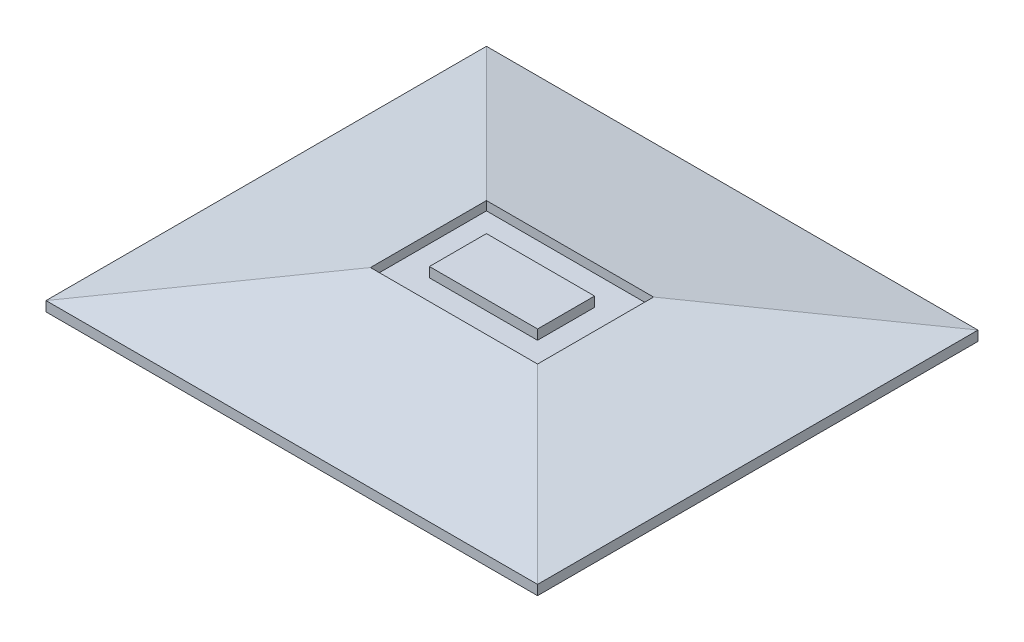
ISO-10303-21;
HEADER;
FILE_DESCRIPTION(('STEP AP214'),'2;1');
FILE_NAME('part.step','',(''),(''),'','','');
FILE_SCHEMA(('AUTOMOTIVE_DESIGN { 1 0 10303 214 1 1 1 1 }'));
ENDSEC;
DATA;
#1=APPLICATION_CONTEXT('core data for automotive mechanical design processes');
#2=APPLICATION_PROTOCOL_DEFINITION('international standard','automotive_design',2000,#1);
#3=PRODUCT_CONTEXT('',#1,'mechanical');
#4=PRODUCT('Part','Part','',(#3));
#5=PRODUCT_RELATED_PRODUCT_CATEGORY('part','',(#4));
#6=PRODUCT_DEFINITION_FORMATION('','',#4);
#7=PRODUCT_DEFINITION_CONTEXT('part definition',#1,'design');
#8=PRODUCT_DEFINITION('design','',#6,#7);
#9=PRODUCT_DEFINITION_SHAPE('','',#8);
#10=(LENGTH_UNIT() NAMED_UNIT(*) SI_UNIT(.MILLI.,.METRE.));
#11=(NAMED_UNIT(*) PLANE_ANGLE_UNIT() SI_UNIT($,.RADIAN.));
#12=(NAMED_UNIT(*) SI_UNIT($,.STERADIAN.) SOLID_ANGLE_UNIT());
#13=UNCERTAINTY_MEASURE_WITH_UNIT(LENGTH_MEASURE(1.E-05),#10,'distance_accuracy_value','');
#14=(GEOMETRIC_REPRESENTATION_CONTEXT(3) GLOBAL_UNCERTAINTY_ASSIGNED_CONTEXT((#13)) GLOBAL_UNIT_ASSIGNED_CONTEXT((#10,
#11,#12)) REPRESENTATION_CONTEXT('',''));
#15=CARTESIAN_POINT('',(0.,0.,0.));
#16=DIRECTION('',(0.,0.,1.));
#17=DIRECTION('',(1.,0.,0.));
#18=AXIS2_PLACEMENT_3D('',#15,#16,#17);
#19=CARTESIAN_POINT('',(0.,4.,0.));
#20=DIRECTION('',(1.,0.,0.));
#21=DIRECTION('',(0.,0.,-1.));
#22=AXIS2_PLACEMENT_3D('',#19,#20,#21);
#23=PLANE('',#22);
#24=DIRECTION('',(0.,-1.,0.));
#25=VECTOR('',#24,1.);
#26=CARTESIAN_POINT('',(0.,4.,44.8));
#27=LINE('',#26,#25);
#28=CARTESIAN_POINT('',(0.,0.999999999999997,44.8));
#29=VERTEX_POINT('',#28);
#30=CARTESIAN_POINT('',(0.,0.,44.8));
#31=VERTEX_POINT('',#30);
#32=EDGE_CURVE('E267',#29,#31,#27,.T.);
#33=ORIENTED_EDGE('',*,*,#32,.F.);
#34=DIRECTION('',(0.,0.,-1.));
#35=VECTOR('',#34,1.);
#36=CARTESIAN_POINT('',(0.,0.999999999999997,0.));
#37=LINE('',#36,#35);
#38=CARTESIAN_POINT('',(0.,0.999999999999997,0.));
#39=VERTEX_POINT('',#38);
#40=EDGE_CURVE('E277',#29,#39,#37,.T.);
#41=ORIENTED_EDGE('',*,*,#40,.T.);
#42=DIRECTION('',(0.,-1.,0.));
#43=VECTOR('',#42,1.);
#44=CARTESIAN_POINT('',(0.,4.,0.));
#45=LINE('',#44,#43);
#46=CARTESIAN_POINT('',(0.,0.,0.));
#47=VERTEX_POINT('',#46);
#48=EDGE_CURVE('E261',#39,#47,#45,.T.);
#49=ORIENTED_EDGE('',*,*,#48,.T.);
#50=DIRECTION('',(0.,0.,1.));
#51=VECTOR('',#50,1.);
#52=CARTESIAN_POINT('',(0.,0.,0.));
#53=LINE('',#52,#51);
#54=EDGE_CURVE('E248',#47,#31,#53,.T.);
#55=ORIENTED_EDGE('',*,*,#54,.T.);
#56=EDGE_LOOP('',(#33,#41,#49,#55));
#57=FACE_BOUND('',#56,.T.);
#58=ADVANCED_FACE('F36',(#57),#23,.F.);
#59=CARTESIAN_POINT('',(0.,4.,44.8));
#60=DIRECTION('',(0.,0.,-1.));
#61=DIRECTION('',(-1.,0.,0.));
#62=AXIS2_PLACEMENT_3D('',#59,#60,#61);
#63=PLANE('',#62);
#64=DIRECTION('',(0.,-1.,0.));
#65=VECTOR('',#64,1.);
#66=CARTESIAN_POINT('',(50.,4.,44.8));
#67=LINE('',#66,#65);
#68=CARTESIAN_POINT('',(50.,0.999999999999997,44.8));
#69=VERTEX_POINT('',#68);
#70=CARTESIAN_POINT('',(50.,0.,44.8));
#71=VERTEX_POINT('',#70);
#72=EDGE_CURVE('E265',#69,#71,#67,.T.);
#73=ORIENTED_EDGE('',*,*,#72,.F.);
#74=DIRECTION('',(-1.,0.,0.));
#75=VECTOR('',#74,1.);
#76=CARTESIAN_POINT('',(0.,0.999999999999997,44.8));
#77=LINE('',#76,#75);
#78=EDGE_CURVE('E272',#69,#29,#77,.T.);
#79=ORIENTED_EDGE('',*,*,#78,.T.);
#80=ORIENTED_EDGE('',*,*,#32,.T.);
#81=DIRECTION('',(1.,0.,0.));
#82=VECTOR('',#81,1.);
#83=CARTESIAN_POINT('',(0.,0.,44.8));
#84=LINE('',#83,#82);
#85=EDGE_CURVE('E251',#31,#71,#84,.T.);
#86=ORIENTED_EDGE('',*,*,#85,.T.);
#87=EDGE_LOOP('',(#73,#79,#80,#86));
#88=FACE_BOUND('',#87,.T.);
#89=ADVANCED_FACE('F309',(#88),#63,.F.);
#90=CARTESIAN_POINT('',(50.,4.,0.));
#91=DIRECTION('',(-1.,0.,0.));
#92=DIRECTION('',(0.,0.,1.));
#93=AXIS2_PLACEMENT_3D('',#90,#91,#92);
#94=PLANE('',#93);
#95=DIRECTION('',(0.,-1.,0.));
#96=VECTOR('',#95,1.);
#97=CARTESIAN_POINT('',(50.,4.,0.));
#98=LINE('',#97,#96);
#99=CARTESIAN_POINT('',(50.,0.999999999999997,0.));
#100=VERTEX_POINT('',#99);
#101=CARTESIAN_POINT('',(50.,0.,0.));
#102=VERTEX_POINT('',#101);
#103=EDGE_CURVE('E263',#100,#102,#98,.T.);
#104=ORIENTED_EDGE('',*,*,#103,.F.);
#105=DIRECTION('',(0.,0.,1.));
#106=VECTOR('',#105,1.);
#107=CARTESIAN_POINT('',(50.,0.999999999999997,44.8));
#108=LINE('',#107,#106);
#109=EDGE_CURVE('E269',#100,#69,#108,.T.);
#110=ORIENTED_EDGE('',*,*,#109,.T.);
#111=ORIENTED_EDGE('',*,*,#72,.T.);
#112=DIRECTION('',(0.,0.,-1.));
#113=VECTOR('',#112,1.);
#114=CARTESIAN_POINT('',(50.,0.,0.));
#115=LINE('',#114,#113);
#116=EDGE_CURVE('E255',#71,#102,#115,.T.);
#117=ORIENTED_EDGE('',*,*,#116,.T.);
#118=EDGE_LOOP('',(#104,#110,#111,#117));
#119=FACE_BOUND('',#118,.T.);
#120=ADVANCED_FACE('F307',(#119),#94,.F.);
#121=CARTESIAN_POINT('',(0.,4.,0.));
#122=DIRECTION('',(0.,0.,1.));
#123=DIRECTION('',(1.,0.,0.));
#124=AXIS2_PLACEMENT_3D('',#121,#122,#123);
#125=PLANE('',#124);
#126=ORIENTED_EDGE('',*,*,#48,.F.);
#127=DIRECTION('',(1.,0.,0.));
#128=VECTOR('',#127,1.);
#129=CARTESIAN_POINT('',(50.,0.999999999999997,0.));
#130=LINE('',#129,#128);
#131=EDGE_CURVE('E275',#39,#100,#130,.T.);
#132=ORIENTED_EDGE('',*,*,#131,.T.);
#133=ORIENTED_EDGE('',*,*,#103,.T.);
#134=DIRECTION('',(-1.,0.,0.));
#135=VECTOR('',#134,1.);
#136=CARTESIAN_POINT('',(0.,0.,0.));
#137=LINE('',#136,#135);
#138=EDGE_CURVE('E258',#102,#47,#137,.T.);
#139=ORIENTED_EDGE('',*,*,#138,.T.);
#140=EDGE_LOOP('',(#126,#132,#133,#139));
#141=FACE_BOUND('',#140,.T.);
#142=ADVANCED_FACE('F319',(#141),#125,.F.);
#143=CARTESIAN_POINT('',(0.,0.,0.));
#144=DIRECTION('',(0.,1.,0.));
#145=DIRECTION('',(0.,0.,1.));
#146=AXIS2_PLACEMENT_3D('',#143,#144,#145);
#147=PLANE('',#146);
#148=ORIENTED_EDGE('',*,*,#54,.F.);
#149=ORIENTED_EDGE('',*,*,#138,.F.);
#150=ORIENTED_EDGE('',*,*,#116,.F.);
#151=ORIENTED_EDGE('',*,*,#85,.F.);
#152=EDGE_LOOP('',(#148,#149,#150,#151));
#153=FACE_BOUND('',#152,.T.);
#154=ADVANCED_FACE('F316',(#153),#147,.F.);
#155=CARTESIAN_POINT('',(17.0138454588531,4.,0.));
#156=DIRECTION('',(-0.173648177666931,0.984807753012208,0.));
#157=DIRECTION('',(0.,0.,-1.));
#158=AXIS2_PLACEMENT_3D('',#155,#156,#157);
#159=PLANE('',#158);
#160=DIRECTION('',(0.,0.,1.));
#161=VECTOR('',#160,1.);
#162=CARTESIAN_POINT('',(16.5,3.90939518168969,0.));
#163=LINE('',#162,#161);
#164=CARTESIAN_POINT('',(16.5,3.90939518168968,16.5));
#165=VERTEX_POINT('',#164);
#166=CARTESIAN_POINT('',(16.5,3.90939518168969,28.3));
#167=VERTEX_POINT('',#166);
#168=EDGE_CURVE('E245',#165,#167,#163,.T.);
#169=ORIENTED_EDGE('',*,*,#168,.F.);
#170=DIRECTION('',(-0.701673843159863,-0.123724030206484,-0.701673843159863));
#171=VECTOR('',#170,1.);
#172=CARTESIAN_POINT('',(8.63714360307584,2.5229614534758,8.63714360307584));
#173=LINE('',#172,#171);
#174=EDGE_CURVE('E283',#39,#165,#173,.F.);
#175=ORIENTED_EDGE('',*,*,#174,.F.);
#176=ORIENTED_EDGE('',*,*,#40,.F.);
#177=DIRECTION('',(0.701673843159863,0.123724030206484,-0.701673843159863));
#178=VECTOR('',#177,1.);
#179=CARTESIAN_POINT('',(30.6942525645039,6.41222487980205,14.1057474354961));
#180=LINE('',#179,#178);
#181=EDGE_CURVE('E252',#167,#29,#180,.F.);
#182=ORIENTED_EDGE('',*,*,#181,.F.);
#183=EDGE_LOOP('',(#169,#175,#176,#182));
#184=FACE_BOUND('',#183,.T.);
#185=ADVANCED_FACE('F39',(#184),#159,.T.);
#186=CARTESIAN_POINT('',(0.,4.,27.7861545411469));
#187=DIRECTION('',(0.,0.984807753012208,0.173648177666931));
#188=DIRECTION('',(-1.,0.,0.));
#189=AXIS2_PLACEMENT_3D('',#186,#187,#188);
#190=PLANE('',#189);
#191=DIRECTION('',(1.,0.,0.));
#192=VECTOR('',#191,1.);
#193=CARTESIAN_POINT('',(0.,3.90939518168968,28.3));
#194=LINE('',#193,#192);
#195=CARTESIAN_POINT('',(33.5,3.90939518168969,28.3));
#196=VERTEX_POINT('',#195);
#197=EDGE_CURVE('E233',#167,#196,#194,.T.);
#198=ORIENTED_EDGE('',*,*,#197,.F.);
#199=ORIENTED_EDGE('',*,*,#181,.T.);
#200=ORIENTED_EDGE('',*,*,#78,.F.);
#201=DIRECTION('',(-0.701673843159863,0.123724030206484,-0.701673843159863));
#202=VECTOR('',#201,1.);
#203=CARTESIAN_POINT('',(16.7455472881875,6.86365724178635,11.5455472881875));
#204=LINE('',#203,#202);
#205=EDGE_CURVE('E281',#196,#69,#204,.F.);
#206=ORIENTED_EDGE('',*,*,#205,.F.);
#207=EDGE_LOOP('',(#198,#199,#200,#206));
#208=FACE_BOUND('',#207,.T.);
#209=ADVANCED_FACE('F333',(#208),#190,.T.);
#210=CARTESIAN_POINT('',(0.,4.,17.0138454588531));
#211=DIRECTION('',(0.,0.984807753012208,-0.173648177666931));
#212=DIRECTION('',(1.,0.,0.));
#213=AXIS2_PLACEMENT_3D('',#210,#211,#212);
#214=PLANE('',#213);
#215=DIRECTION('',(-1.,0.,0.));
#216=VECTOR('',#215,1.);
#217=CARTESIAN_POINT('',(0.,3.90939518168969,16.5));
#218=LINE('',#217,#216);
#219=CARTESIAN_POINT('',(33.5,3.90939518168969,16.5));
#220=VERTEX_POINT('',#219);
#221=EDGE_CURVE('E243',#220,#165,#218,.T.);
#222=ORIENTED_EDGE('',*,*,#221,.F.);
#223=DIRECTION('',(0.701673843159863,-0.123724030206484,-0.701673843159863));
#224=VECTOR('',#223,1.);
#225=CARTESIAN_POINT('',(16.7455472881875,6.86365724178635,33.2544527118125));
#226=LINE('',#225,#224);
#227=EDGE_CURVE('E247',#100,#220,#226,.F.);
#228=ORIENTED_EDGE('',*,*,#227,.F.);
#229=ORIENTED_EDGE('',*,*,#131,.F.);
#230=ORIENTED_EDGE('',*,*,#174,.T.);
#231=EDGE_LOOP('',(#222,#228,#229,#230));
#232=FACE_BOUND('',#231,.T.);
#233=ADVANCED_FACE('F298',(#232),#214,.T.);
#234=CARTESIAN_POINT('',(32.986154541147,4.,0.));
#235=DIRECTION('',(0.173648177666931,0.984807753012208,0.));
#236=DIRECTION('',(0.,0.,1.));
#237=AXIS2_PLACEMENT_3D('',#234,#235,#236);
#238=PLANE('',#237);
#239=DIRECTION('',(0.,0.,-1.));
#240=VECTOR('',#239,1.);
#241=CARTESIAN_POINT('',(33.5,3.90939518168969,0.));
#242=LINE('',#241,#240);
#243=EDGE_CURVE('E46',#196,#220,#242,.T.);
#244=ORIENTED_EDGE('',*,*,#243,.F.);
#245=ORIENTED_EDGE('',*,*,#205,.T.);
#246=ORIENTED_EDGE('',*,*,#109,.F.);
#247=ORIENTED_EDGE('',*,*,#227,.T.);
#248=EDGE_LOOP('',(#244,#245,#246,#247));
#249=FACE_BOUND('',#248,.T.);
#250=ADVANCED_FACE('F302',(#249),#238,.T.);
#251=CARTESIAN_POINT('',(16.5,3.,16.5));
#252=DIRECTION('',(-1.,0.,0.));
#253=DIRECTION('',(0.,0.,1.));
#254=AXIS2_PLACEMENT_3D('',#251,#252,#253);
#255=PLANE('',#254);
#256=ORIENTED_EDGE('',*,*,#168,.T.);
#257=DIRECTION('',(0.,1.,0.));
#258=VECTOR('',#257,1.);
#259=CARTESIAN_POINT('',(16.5,3.,28.3));
#260=LINE('',#259,#258);
#261=CARTESIAN_POINT('',(16.5,3.,28.3));
#262=VERTEX_POINT('',#261);
#263=EDGE_CURVE('E229',#262,#167,#260,.T.);
#264=ORIENTED_EDGE('',*,*,#263,.F.);
#265=DIRECTION('',(0.,0.,1.));
#266=VECTOR('',#265,1.);
#267=CARTESIAN_POINT('',(16.5,3.,16.5));
#268=LINE('',#267,#266);
#269=CARTESIAN_POINT('',(16.5,3.,16.5));
#270=VERTEX_POINT('',#269);
#271=EDGE_CURVE('E211',#270,#262,#268,.T.);
#272=ORIENTED_EDGE('',*,*,#271,.F.);
#273=DIRECTION('',(0.,1.,0.));
#274=VECTOR('',#273,1.);
#275=CARTESIAN_POINT('',(16.5,3.,16.5));
#276=LINE('',#275,#274);
#277=EDGE_CURVE('E230',#270,#165,#276,.T.);
#278=ORIENTED_EDGE('',*,*,#277,.T.);
#279=EDGE_LOOP('',(#256,#264,#272,#278));
#280=FACE_BOUND('',#279,.T.);
#281=ADVANCED_FACE('F326',(#280),#255,.F.);
#282=CARTESIAN_POINT('',(16.5,3.,16.5));
#283=DIRECTION('',(0.,0.,-1.));
#284=DIRECTION('',(-1.,0.,0.));
#285=AXIS2_PLACEMENT_3D('',#282,#283,#284);
#286=PLANE('',#285);
#287=ORIENTED_EDGE('',*,*,#221,.T.);
#288=ORIENTED_EDGE('',*,*,#277,.F.);
#289=DIRECTION('',(-1.,0.,0.));
#290=VECTOR('',#289,1.);
#291=CARTESIAN_POINT('',(16.5,3.,16.5));
#292=LINE('',#291,#290);
#293=CARTESIAN_POINT('',(33.5,3.,16.5));
#294=VERTEX_POINT('',#293);
#295=EDGE_CURVE('E226',#294,#270,#292,.T.);
#296=ORIENTED_EDGE('',*,*,#295,.F.);
#297=DIRECTION('',(0.,1.,0.));
#298=VECTOR('',#297,1.);
#299=CARTESIAN_POINT('',(33.5,3.,16.5));
#300=LINE('',#299,#298);
#301=EDGE_CURVE('E234',#294,#220,#300,.T.);
#302=ORIENTED_EDGE('',*,*,#301,.T.);
#303=EDGE_LOOP('',(#287,#288,#296,#302));
#304=FACE_BOUND('',#303,.T.);
#305=ADVANCED_FACE('F295',(#304),#286,.F.);
#306=CARTESIAN_POINT('',(33.5,3.,16.5));
#307=DIRECTION('',(1.,0.,0.));
#308=DIRECTION('',(0.,0.,-1.));
#309=AXIS2_PLACEMENT_3D('',#306,#307,#308);
#310=PLANE('',#309);
#311=ORIENTED_EDGE('',*,*,#243,.T.);
#312=ORIENTED_EDGE('',*,*,#301,.F.);
#313=DIRECTION('',(0.,0.,-1.));
#314=VECTOR('',#313,1.);
#315=CARTESIAN_POINT('',(33.5,3.,16.5));
#316=LINE('',#315,#314);
#317=CARTESIAN_POINT('',(33.5,3.,28.3));
#318=VERTEX_POINT('',#317);
#319=EDGE_CURVE('E223',#318,#294,#316,.T.);
#320=ORIENTED_EDGE('',*,*,#319,.F.);
#321=DIRECTION('',(0.,1.,0.));
#322=VECTOR('',#321,1.);
#323=CARTESIAN_POINT('',(33.5,3.,28.3));
#324=LINE('',#323,#322);
#325=EDGE_CURVE('E237',#318,#196,#324,.T.);
#326=ORIENTED_EDGE('',*,*,#325,.T.);
#327=EDGE_LOOP('',(#311,#312,#320,#326));
#328=FACE_BOUND('',#327,.T.);
#329=ADVANCED_FACE('F288',(#328),#310,.F.);
#330=CARTESIAN_POINT('',(16.5,3.,28.3));
#331=DIRECTION('',(0.,0.,1.));
#332=DIRECTION('',(1.,0.,0.));
#333=AXIS2_PLACEMENT_3D('',#330,#331,#332);
#334=PLANE('',#333);
#335=ORIENTED_EDGE('',*,*,#197,.T.);
#336=ORIENTED_EDGE('',*,*,#325,.F.);
#337=DIRECTION('',(1.,0.,0.));
#338=VECTOR('',#337,1.);
#339=CARTESIAN_POINT('',(16.5,3.,28.3));
#340=LINE('',#339,#338);
#341=EDGE_CURVE('E220',#262,#318,#340,.T.);
#342=ORIENTED_EDGE('',*,*,#341,.F.);
#343=ORIENTED_EDGE('',*,*,#263,.T.);
#344=EDGE_LOOP('',(#335,#336,#342,#343));
#345=FACE_BOUND('',#344,.T.);
#346=ADVANCED_FACE('F331',(#345),#334,.F.);
#347=CARTESIAN_POINT('',(0.,3.,0.));
#348=DIRECTION('',(0.,1.,0.));
#349=DIRECTION('',(0.,0.,1.));
#350=AXIS2_PLACEMENT_3D('',#347,#348,#349);
#351=PLANE('',#350);
#352=DIRECTION('',(-1.,0.,0.));
#353=VECTOR('',#352,1.);
#354=CARTESIAN_POINT('',(19.5,3.,19.5));
#355=LINE('',#354,#353);
#356=CARTESIAN_POINT('',(30.5,3.,19.5));
#357=VERTEX_POINT('',#356);
#358=CARTESIAN_POINT('',(19.5,3.,19.5));
#359=VERTEX_POINT('',#358);
#360=EDGE_CURVE('E195',#357,#359,#355,.T.);
#361=ORIENTED_EDGE('',*,*,#360,.F.);
#362=DIRECTION('',(0.,0.,-1.));
#363=VECTOR('',#362,1.);
#364=CARTESIAN_POINT('',(30.5,3.,19.5));
#365=LINE('',#364,#363);
#366=CARTESIAN_POINT('',(30.5,3.,25.3));
#367=VERTEX_POINT('',#366);
#368=EDGE_CURVE('E192',#367,#357,#365,.T.);
#369=ORIENTED_EDGE('',*,*,#368,.F.);
#370=DIRECTION('',(1.,0.,0.));
#371=VECTOR('',#370,1.);
#372=CARTESIAN_POINT('',(19.5,3.,25.3));
#373=LINE('',#372,#371);
#374=CARTESIAN_POINT('',(19.5,3.,25.3));
#375=VERTEX_POINT('',#374);
#376=EDGE_CURVE('E188',#375,#367,#373,.T.);
#377=ORIENTED_EDGE('',*,*,#376,.F.);
#378=DIRECTION('',(0.,0.,1.));
#379=VECTOR('',#378,1.);
#380=CARTESIAN_POINT('',(19.5,3.,19.5));
#381=LINE('',#380,#379);
#382=EDGE_CURVE('E185',#359,#375,#381,.T.);
#383=ORIENTED_EDGE('',*,*,#382,.F.);
#384=EDGE_LOOP('',(#361,#369,#377,#383));
#385=FACE_BOUND('',#384,.T.);
#386=ORIENTED_EDGE('',*,*,#271,.T.);
#387=ORIENTED_EDGE('',*,*,#341,.T.);
#388=ORIENTED_EDGE('',*,*,#319,.T.);
#389=ORIENTED_EDGE('',*,*,#295,.T.);
#390=EDGE_LOOP('',(#386,#387,#388,#389));
#391=FACE_BOUND('',#390,.T.);
#392=ADVANCED_FACE('F437',(#385,#391),#351,.T.);
#393=CARTESIAN_POINT('',(19.5,3.,19.5));
#394=DIRECTION('',(-1.,0.,0.));
#395=DIRECTION('',(0.,0.,1.));
#396=AXIS2_PLACEMENT_3D('',#393,#394,#395);
#397=PLANE('',#396);
#398=DIRECTION('',(0.,0.,1.));
#399=VECTOR('',#398,1.);
#400=CARTESIAN_POINT('',(19.5,4.,19.5));
#401=LINE('',#400,#399);
#402=CARTESIAN_POINT('',(19.5,4.,19.5));
#403=VERTEX_POINT('',#402);
#404=CARTESIAN_POINT('',(19.5,4.,25.3));
#405=VERTEX_POINT('',#404);
#406=EDGE_CURVE('E181',#403,#405,#401,.T.);
#407=ORIENTED_EDGE('',*,*,#406,.F.);
#408=DIRECTION('',(0.,1.,0.));
#409=VECTOR('',#408,1.);
#410=CARTESIAN_POINT('',(19.5,3.,19.5));
#411=LINE('',#410,#409);
#412=EDGE_CURVE('E209',#359,#403,#411,.T.);
#413=ORIENTED_EDGE('',*,*,#412,.F.);
#414=ORIENTED_EDGE('',*,*,#382,.T.);
#415=DIRECTION('',(0.,1.,0.));
#416=VECTOR('',#415,1.);
#417=CARTESIAN_POINT('',(19.5,3.,25.3));
#418=LINE('',#417,#416);
#419=EDGE_CURVE('E198',#375,#405,#418,.T.);
#420=ORIENTED_EDGE('',*,*,#419,.T.);
#421=EDGE_LOOP('',(#407,#413,#414,#420));
#422=FACE_BOUND('',#421,.T.);
#423=ADVANCED_FACE('F445',(#422),#397,.T.);
#424=CARTESIAN_POINT('',(19.5,3.,19.5));
#425=DIRECTION('',(0.,0.,-1.));
#426=DIRECTION('',(-1.,0.,0.));
#427=AXIS2_PLACEMENT_3D('',#424,#425,#426);
#428=PLANE('',#427);
#429=DIRECTION('',(-1.,0.,0.));
#430=VECTOR('',#429,1.);
#431=CARTESIAN_POINT('',(19.5,4.,19.5));
#432=LINE('',#431,#430);
#433=CARTESIAN_POINT('',(30.5,4.,19.5));
#434=VERTEX_POINT('',#433);
#435=EDGE_CURVE('E189',#434,#403,#432,.T.);
#436=ORIENTED_EDGE('',*,*,#435,.F.);
#437=DIRECTION('',(0.,1.,0.));
#438=VECTOR('',#437,1.);
#439=CARTESIAN_POINT('',(30.5,3.,19.5));
#440=LINE('',#439,#438);
#441=EDGE_CURVE('E212',#357,#434,#440,.T.);
#442=ORIENTED_EDGE('',*,*,#441,.F.);
#443=ORIENTED_EDGE('',*,*,#360,.T.);
#444=ORIENTED_EDGE('',*,*,#412,.T.);
#445=EDGE_LOOP('',(#436,#442,#443,#444));
#446=FACE_BOUND('',#445,.T.);
#447=ADVANCED_FACE('F455',(#446),#428,.T.);
#448=CARTESIAN_POINT('',(30.5,3.,19.5));
#449=DIRECTION('',(1.,0.,0.));
#450=DIRECTION('',(0.,0.,-1.));
#451=AXIS2_PLACEMENT_3D('',#448,#449,#450);
#452=PLANE('',#451);
#453=DIRECTION('',(0.,0.,-1.));
#454=VECTOR('',#453,1.);
#455=CARTESIAN_POINT('',(30.5,4.,19.5));
#456=LINE('',#455,#454);
#457=CARTESIAN_POINT('',(30.5,4.,25.3));
#458=VERTEX_POINT('',#457);
#459=EDGE_CURVE('E204',#458,#434,#456,.T.);
#460=ORIENTED_EDGE('',*,*,#459,.F.);
#461=DIRECTION('',(0.,1.,0.));
#462=VECTOR('',#461,1.);
#463=CARTESIAN_POINT('',(30.5,3.,25.3));
#464=LINE('',#463,#462);
#465=EDGE_CURVE('E214',#367,#458,#464,.T.);
#466=ORIENTED_EDGE('',*,*,#465,.F.);
#467=ORIENTED_EDGE('',*,*,#368,.T.);
#468=ORIENTED_EDGE('',*,*,#441,.T.);
#469=EDGE_LOOP('',(#460,#466,#467,#468));
#470=FACE_BOUND('',#469,.T.);
#471=ADVANCED_FACE('F465',(#470),#452,.T.);
#472=CARTESIAN_POINT('',(19.5,3.,25.3));
#473=DIRECTION('',(0.,0.,1.));
#474=DIRECTION('',(1.,0.,0.));
#475=AXIS2_PLACEMENT_3D('',#472,#473,#474);
#476=PLANE('',#475);
#477=DIRECTION('',(1.,0.,0.));
#478=VECTOR('',#477,1.);
#479=CARTESIAN_POINT('',(19.5,4.,25.3));
#480=LINE('',#479,#478);
#481=EDGE_CURVE('E201',#405,#458,#480,.T.);
#482=ORIENTED_EDGE('',*,*,#481,.F.);
#483=ORIENTED_EDGE('',*,*,#419,.F.);
#484=ORIENTED_EDGE('',*,*,#376,.T.);
#485=ORIENTED_EDGE('',*,*,#465,.T.);
#486=EDGE_LOOP('',(#482,#483,#484,#485));
#487=FACE_BOUND('',#486,.T.);
#488=ADVANCED_FACE('F374',(#487),#476,.T.);
#489=CARTESIAN_POINT('',(0.,4.,0.));
#490=DIRECTION('',(0.,1.,0.));
#491=DIRECTION('',(0.,0.,1.));
#492=AXIS2_PLACEMENT_3D('',#489,#490,#491);
#493=PLANE('',#492);
#494=ORIENTED_EDGE('',*,*,#435,.T.);
#495=ORIENTED_EDGE('',*,*,#406,.T.);
#496=ORIENTED_EDGE('',*,*,#481,.T.);
#497=ORIENTED_EDGE('',*,*,#459,.T.);
#498=EDGE_LOOP('',(#494,#495,#496,#497));
#499=FACE_BOUND('',#498,.T.);
#500=ADVANCED_FACE('F371',(#499),#493,.T.);
#501=CLOSED_SHELL('',(#58,#89,#120,#142,#154,#185,#209,#233,#250,#281,#305,#329,#346,#392,#423,
#447,#471,#488,#500));
#502=CARTESIAN_POINT('',(0.,3.,0.));
#503=DIRECTION('',(0.,1.,0.));
#504=DIRECTION('',(0.,0.,1.));
#505=AXIS2_PLACEMENT_3D('',#502,#503,#504);
#506=PLANE('',#505);
#507=DIRECTION('',(-1.,0.,0.));
#508=VECTOR('',#507,1.);
#509=CARTESIAN_POINT('',(19.9,3.,25.));
#510=LINE('',#509,#508);
#511=CARTESIAN_POINT('',(30.1,3.,25.));
#512=VERTEX_POINT('',#511);
#513=CARTESIAN_POINT('',(19.9,3.,25.));
#514=VERTEX_POINT('',#513);
#515=EDGE_CURVE('E11',#512,#514,#510,.T.);
#516=ORIENTED_EDGE('',*,*,#515,.T.);
#517=DIRECTION('',(0.,0.,-1.));
#518=VECTOR('',#517,1.);
#519=CARTESIAN_POINT('',(19.9,3.,19.9));
#520=LINE('',#519,#518);
#521=CARTESIAN_POINT('',(19.9,3.,19.9));
#522=VERTEX_POINT('',#521);
#523=EDGE_CURVE('E163',#514,#522,#520,.T.);
#524=ORIENTED_EDGE('',*,*,#523,.T.);
#525=DIRECTION('',(1.,0.,0.));
#526=VECTOR('',#525,1.);
#527=CARTESIAN_POINT('',(19.9,3.,19.9));
#528=LINE('',#527,#526);
#529=CARTESIAN_POINT('',(30.1,3.,19.9));
#530=VERTEX_POINT('',#529);
#531=EDGE_CURVE('E53',#522,#530,#528,.T.);
#532=ORIENTED_EDGE('',*,*,#531,.T.);
#533=DIRECTION('',(0.,0.,1.));
#534=VECTOR('',#533,1.);
#535=CARTESIAN_POINT('',(30.1,3.,19.9));
#536=LINE('',#535,#534);
#537=EDGE_CURVE('E61',#530,#512,#536,.T.);
#538=ORIENTED_EDGE('',*,*,#537,.T.);
#539=EDGE_LOOP('',(#516,#524,#532,#538));
#540=FACE_BOUND('',#539,.T.);
#541=ADVANCED_FACE('F169',(#540),#506,.F.);
#542=CARTESIAN_POINT('',(0.,1.,0.));
#543=DIRECTION('',(0.,1.,0.));
#544=DIRECTION('',(0.,0.,1.));
#545=AXIS2_PLACEMENT_3D('',#542,#543,#544);
#546=PLANE('',#545);
#547=DIRECTION('',(0.,0.,1.));
#548=VECTOR('',#547,1.);
#549=CARTESIAN_POINT('',(19.9,1.,19.9));
#550=LINE('',#549,#548);
#551=CARTESIAN_POINT('',(19.9,1.,19.9));
#552=VERTEX_POINT('',#551);
#553=CARTESIAN_POINT('',(19.9,1.,25.));
#554=VERTEX_POINT('',#553);
#555=EDGE_CURVE('E167',#552,#554,#550,.T.);
#556=ORIENTED_EDGE('',*,*,#555,.T.);
#557=DIRECTION('',(1.,0.,0.));
#558=VECTOR('',#557,1.);
#559=CARTESIAN_POINT('',(19.9,1.,25.));
#560=LINE('',#559,#558);
#561=CARTESIAN_POINT('',(30.1,1.,25.));
#562=VERTEX_POINT('',#561);
#563=EDGE_CURVE('E155',#554,#562,#560,.T.);
#564=ORIENTED_EDGE('',*,*,#563,.T.);
#565=DIRECTION('',(0.,0.,-1.));
#566=VECTOR('',#565,1.);
#567=CARTESIAN_POINT('',(30.1,1.,19.9));
#568=LINE('',#567,#566);
#569=CARTESIAN_POINT('',(30.1,1.,19.9));
#570=VERTEX_POINT('',#569);
#571=EDGE_CURVE('E175',#562,#570,#568,.T.);
#572=ORIENTED_EDGE('',*,*,#571,.T.);
#573=DIRECTION('',(-1.,0.,0.));
#574=VECTOR('',#573,1.);
#575=CARTESIAN_POINT('',(19.9,1.,19.9));
#576=LINE('',#575,#574);
#577=EDGE_CURVE('E160',#570,#552,#576,.T.);
#578=ORIENTED_EDGE('',*,*,#577,.T.);
#579=EDGE_LOOP('',(#556,#564,#572,#578));
#580=FACE_BOUND('',#579,.T.);
#581=ADVANCED_FACE('F490',(#580),#546,.T.);
#582=CARTESIAN_POINT('',(19.9,1.,25.));
#583=DIRECTION('',(0.,0.,1.));
#584=DIRECTION('',(1.,0.,0.));
#585=AXIS2_PLACEMENT_3D('',#582,#583,#584);
#586=PLANE('',#585);
#587=ORIENTED_EDGE('',*,*,#515,.F.);
#588=DIRECTION('',(0.,1.,0.));
#589=VECTOR('',#588,1.);
#590=CARTESIAN_POINT('',(30.1,1.,25.));
#591=LINE('',#590,#589);
#592=EDGE_CURVE('E159',#562,#512,#591,.T.);
#593=ORIENTED_EDGE('',*,*,#592,.F.);
#594=ORIENTED_EDGE('',*,*,#563,.F.);
#595=DIRECTION('',(0.,1.,0.));
#596=VECTOR('',#595,1.);
#597=CARTESIAN_POINT('',(19.9,1.,25.));
#598=LINE('',#597,#596);
#599=EDGE_CURVE('E151',#554,#514,#598,.T.);
#600=ORIENTED_EDGE('',*,*,#599,.T.);
#601=EDGE_LOOP('',(#587,#593,#594,#600));
#602=FACE_BOUND('',#601,.T.);
#603=ADVANCED_FACE('F153',(#602),#586,.F.);
#604=CARTESIAN_POINT('',(30.1,1.,19.9));
#605=DIRECTION('',(1.,0.,0.));
#606=DIRECTION('',(0.,0.,-1.));
#607=AXIS2_PLACEMENT_3D('',#604,#605,#606);
#608=PLANE('',#607);
#609=ORIENTED_EDGE('',*,*,#537,.F.);
#610=DIRECTION('',(0.,1.,0.));
#611=VECTOR('',#610,1.);
#612=CARTESIAN_POINT('',(30.1,1.,19.9));
#613=LINE('',#612,#611);
#614=EDGE_CURVE('E182',#570,#530,#613,.T.);
#615=ORIENTED_EDGE('',*,*,#614,.F.);
#616=ORIENTED_EDGE('',*,*,#571,.F.);
#617=ORIENTED_EDGE('',*,*,#592,.T.);
#618=EDGE_LOOP('',(#609,#615,#616,#617));
#619=FACE_BOUND('',#618,.T.);
#620=ADVANCED_FACE('F519',(#619),#608,.F.);
#621=CARTESIAN_POINT('',(19.9,1.,19.9));
#622=DIRECTION('',(0.,0.,-1.));
#623=DIRECTION('',(-1.,0.,0.));
#624=AXIS2_PLACEMENT_3D('',#621,#622,#623);
#625=PLANE('',#624);
#626=ORIENTED_EDGE('',*,*,#531,.F.);
#627=DIRECTION('',(0.,1.,0.));
#628=VECTOR('',#627,1.);
#629=CARTESIAN_POINT('',(19.9,1.,19.9));
#630=LINE('',#629,#628);
#631=EDGE_CURVE('E165',#552,#522,#630,.T.);
#632=ORIENTED_EDGE('',*,*,#631,.F.);
#633=ORIENTED_EDGE('',*,*,#577,.F.);
#634=ORIENTED_EDGE('',*,*,#614,.T.);
#635=EDGE_LOOP('',(#626,#632,#633,#634));
#636=FACE_BOUND('',#635,.T.);
#637=ADVANCED_FACE('F528',(#636),#625,.F.);
#638=CARTESIAN_POINT('',(19.9,1.,19.9));
#639=DIRECTION('',(-1.,0.,0.));
#640=DIRECTION('',(0.,0.,1.));
#641=AXIS2_PLACEMENT_3D('',#638,#639,#640);
#642=PLANE('',#641);
#643=ORIENTED_EDGE('',*,*,#523,.F.);
#644=ORIENTED_EDGE('',*,*,#599,.F.);
#645=ORIENTED_EDGE('',*,*,#555,.F.);
#646=ORIENTED_EDGE('',*,*,#631,.T.);
#647=EDGE_LOOP('',(#643,#644,#645,#646));
#648=FACE_BOUND('',#647,.T.);
#649=ADVANCED_FACE('F164',(#648),#642,.F.);
#650=CLOSED_SHELL('',(#541,#581,#603,#620,#637,#649));
#651=ORIENTED_CLOSED_SHELL('',*,#650,.T.);
#652=BREP_WITH_VOIDS('B2',#501,(#651));
#653=ADVANCED_BREP_SHAPE_REPRESENTATION('',(#18,#652),#14);
#654=SHAPE_DEFINITION_REPRESENTATION(#9,#653);
ENDSEC;
END-ISO-10303-21;
